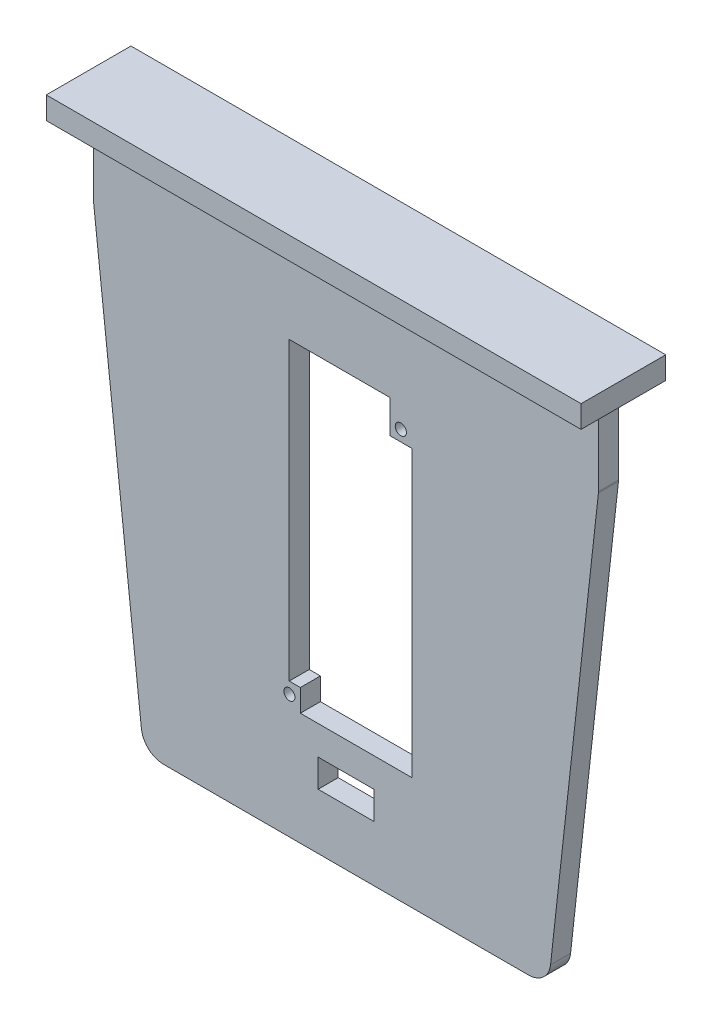
ISO-10303-21;
HEADER;
FILE_DESCRIPTION(('STEP AP214'),'2;1');
FILE_NAME('part.step','',(''),(''),'','','');
FILE_SCHEMA(('AUTOMOTIVE_DESIGN { 1 0 10303 214 1 1 1 1 }'));
ENDSEC;
DATA;
#1=APPLICATION_CONTEXT('core data for automotive mechanical design processes');
#2=APPLICATION_PROTOCOL_DEFINITION('international standard','automotive_design',2000,#1);
#3=PRODUCT_CONTEXT('',#1,'mechanical');
#4=PRODUCT('Part','Part','',(#3));
#5=PRODUCT_RELATED_PRODUCT_CATEGORY('part','',(#4));
#6=PRODUCT_DEFINITION_FORMATION('','',#4);
#7=PRODUCT_DEFINITION_CONTEXT('part definition',#1,'design');
#8=PRODUCT_DEFINITION('design','',#6,#7);
#9=PRODUCT_DEFINITION_SHAPE('','',#8);
#10=(LENGTH_UNIT() NAMED_UNIT(*) SI_UNIT(.MILLI.,.METRE.));
#11=(NAMED_UNIT(*) PLANE_ANGLE_UNIT() SI_UNIT($,.RADIAN.));
#12=(NAMED_UNIT(*) SI_UNIT($,.STERADIAN.) SOLID_ANGLE_UNIT());
#13=UNCERTAINTY_MEASURE_WITH_UNIT(LENGTH_MEASURE(1.E-05),#10,'distance_accuracy_value','');
#14=(GEOMETRIC_REPRESENTATION_CONTEXT(3) GLOBAL_UNCERTAINTY_ASSIGNED_CONTEXT((#13)) GLOBAL_UNIT_ASSIGNED_CONTEXT((#10,
#11,#12)) REPRESENTATION_CONTEXT('',''));
#15=CARTESIAN_POINT('',(0.,0.,0.));
#16=DIRECTION('',(0.,0.,1.));
#17=DIRECTION('',(1.,0.,0.));
#18=AXIS2_PLACEMENT_3D('',#15,#16,#17);
#19=CARTESIAN_POINT('',(-36.6639771710038,-49.3732840688926,-4.572));
#20=DIRECTION('',(0.,0.,1.));
#21=DIRECTION('',(1.,0.,0.));
#22=AXIS2_PLACEMENT_3D('',#19,#20,#21);
#23=CYLINDRICAL_SURFACE('',#22,5.08);
#24=CARTESIAN_POINT('',(-36.6639771710038,-49.3732840688926,0.));
#25=DIRECTION('',(0.,0.,-1.));
#26=DIRECTION('',(1.,0.,0.));
#27=AXIS2_PLACEMENT_3D('',#24,#25,#26);
#28=CIRCLE('',#27,5.08);
#29=CARTESIAN_POINT('',(-36.6639771710038,-54.4532840688926,0.));
#30=VERTEX_POINT('',#29);
#31=CARTESIAN_POINT('',(-41.7131564683568,-49.9320223109896,0.));
#32=VERTEX_POINT('',#31);
#33=EDGE_CURVE('E389',#30,#32,#28,.T.);
#34=ORIENTED_EDGE('',*,*,#33,.T.);
#35=DIRECTION('',(0.,0.,1.));
#36=VECTOR('',#35,1.);
#37=CARTESIAN_POINT('',(-41.7131564683568,-49.9320223109896,-4.572));
#38=LINE('',#37,#36);
#39=CARTESIAN_POINT('',(-41.7131564683568,-49.9320223109896,-4.572));
#40=VERTEX_POINT('',#39);
#41=EDGE_CURVE('E422',#40,#32,#38,.T.);
#42=ORIENTED_EDGE('',*,*,#41,.F.);
#43=CARTESIAN_POINT('',(-36.6639771710038,-49.3732840688926,-4.572));
#44=DIRECTION('',(0.,0.,-1.));
#45=DIRECTION('',(1.,0.,0.));
#46=AXIS2_PLACEMENT_3D('',#43,#44,#45);
#47=CIRCLE('',#46,5.08);
#48=CARTESIAN_POINT('',(-36.6639771710038,-54.4532840688926,-4.572));
#49=VERTEX_POINT('',#48);
#50=EDGE_CURVE('E390',#49,#40,#47,.T.);
#51=ORIENTED_EDGE('',*,*,#50,.F.);
#52=DIRECTION('',(0.,0.,1.));
#53=VECTOR('',#52,1.);
#54=CARTESIAN_POINT('',(-36.6639771710038,-54.4532840688926,-4.572));
#55=LINE('',#54,#53);
#56=EDGE_CURVE('E403',#49,#30,#55,.T.);
#57=ORIENTED_EDGE('',*,*,#56,.T.);
#58=EDGE_LOOP('',(#34,#42,#51,#57));
#59=FACE_BOUND('',#58,.T.);
#60=ADVANCED_FACE('F92',(#59),#23,.T.);
#61=CARTESIAN_POINT('',(-52.6441293610038,48.8484760890104,-4.572));
#62=DIRECTION('',(0.993932932549808,0.109987842932478,0.));
#63=DIRECTION('',(-0.109987842932478,0.993932932549808,0.));
#64=AXIS2_PLACEMENT_3D('',#61,#62,#63);
#65=PLANE('',#64);
#66=DIRECTION('',(-0.109987842932478,0.993932932549808,0.));
#67=VECTOR('',#66,1.);
#68=CARTESIAN_POINT('',(-52.6441293610038,48.8484760890104,0.));
#69=LINE('',#68,#67);
#70=CARTESIAN_POINT('',(-52.6287190096803,48.7092165556455,0.));
#71=VERTEX_POINT('',#70);
#72=EDGE_CURVE('E406',#32,#71,#69,.T.);
#73=ORIENTED_EDGE('',*,*,#72,.T.);
#74=DIRECTION('',(0.,0.,1.));
#75=VECTOR('',#74,1.);
#76=CARTESIAN_POINT('',(-52.6287190096803,48.7092165556455,-4.572));
#77=LINE('',#76,#75);
#78=CARTESIAN_POINT('',(-52.6287190096803,48.7092165556455,-4.572));
#79=VERTEX_POINT('',#78);
#80=EDGE_CURVE('E441',#71,#79,#77,.F.);
#81=ORIENTED_EDGE('',*,*,#80,.T.);
#82=DIRECTION('',(-0.109987842932478,0.993932932549808,0.));
#83=VECTOR('',#82,1.);
#84=CARTESIAN_POINT('',(-52.6441293610038,48.8484760890104,-4.572));
#85=LINE('',#84,#83);
#86=EDGE_CURVE('E393',#40,#79,#85,.T.);
#87=ORIENTED_EDGE('',*,*,#86,.F.);
#88=ORIENTED_EDGE('',*,*,#41,.T.);
#89=EDGE_LOOP('',(#73,#81,#87,#88));
#90=FACE_BOUND('',#89,.T.);
#91=ADVANCED_FACE('F521',(#90),#65,.F.);
#92=CARTESIAN_POINT('',(62.4874158389962,48.8484760890104,-4.572));
#93=DIRECTION('',(-0.993932932549808,0.109987842932478,0.));
#94=DIRECTION('',(-0.109987842932478,-0.993932932549808,0.));
#95=AXIS2_PLACEMENT_3D('',#92,#93,#94);
#96=PLANE('',#95);
#97=DIRECTION('',(-0.109987842932478,-0.993932932549808,0.));
#98=VECTOR('',#97,1.);
#99=CARTESIAN_POINT('',(62.4874158389962,48.8484760890104,-4.572));
#100=LINE('',#99,#98);
#101=CARTESIAN_POINT('',(62.4720054876727,48.7092165556455,-4.572));
#102=VERTEX_POINT('',#101);
#103=CARTESIAN_POINT('',(51.5564429463492,-49.9320223109896,-4.572));
#104=VERTEX_POINT('',#103);
#105=EDGE_CURVE('E397',#102,#104,#100,.T.);
#106=ORIENTED_EDGE('',*,*,#105,.F.);
#107=DIRECTION('',(0.,0.,1.));
#108=VECTOR('',#107,1.);
#109=CARTESIAN_POINT('',(62.4720054876727,48.7092165556455,-4.572));
#110=LINE('',#109,#108);
#111=CARTESIAN_POINT('',(62.4720054876727,48.7092165556455,0.));
#112=VERTEX_POINT('',#111);
#113=EDGE_CURVE('E425',#102,#112,#110,.T.);
#114=ORIENTED_EDGE('',*,*,#113,.T.);
#115=DIRECTION('',(-0.109987842932478,-0.993932932549808,0.));
#116=VECTOR('',#115,1.);
#117=CARTESIAN_POINT('',(62.4874158389962,48.8484760890104,0.));
#118=LINE('',#117,#116);
#119=CARTESIAN_POINT('',(51.5564429463492,-49.9320223109896,0.));
#120=VERTEX_POINT('',#119);
#121=EDGE_CURVE('E409',#112,#120,#118,.T.);
#122=ORIENTED_EDGE('',*,*,#121,.T.);
#123=DIRECTION('',(0.,0.,1.));
#124=VECTOR('',#123,1.);
#125=CARTESIAN_POINT('',(51.5564429463492,-49.9320223109896,-4.572));
#126=LINE('',#125,#124);
#127=EDGE_CURVE('E419',#104,#120,#126,.T.);
#128=ORIENTED_EDGE('',*,*,#127,.F.);
#129=EDGE_LOOP('',(#106,#114,#122,#128));
#130=FACE_BOUND('',#129,.T.);
#131=ADVANCED_FACE('F493',(#130),#96,.F.);
#132=CARTESIAN_POINT('',(46.5072636489962,-49.3732840688926,-4.572));
#133=DIRECTION('',(0.,0.,1.));
#134=DIRECTION('',(1.,0.,0.));
#135=AXIS2_PLACEMENT_3D('',#132,#133,#134);
#136=CYLINDRICAL_SURFACE('',#135,5.08);
#137=CARTESIAN_POINT('',(46.5072636489962,-49.3732840688926,0.));
#138=DIRECTION('',(0.,0.,-1.));
#139=DIRECTION('',(-1.,0.,0.));
#140=AXIS2_PLACEMENT_3D('',#137,#138,#139);
#141=CIRCLE('',#140,5.08);
#142=CARTESIAN_POINT('',(46.5072636489962,-54.4532840688926,0.));
#143=VERTEX_POINT('',#142);
#144=EDGE_CURVE('E411',#120,#143,#141,.T.);
#145=ORIENTED_EDGE('',*,*,#144,.T.);
#146=DIRECTION('',(0.,0.,1.));
#147=VECTOR('',#146,1.);
#148=CARTESIAN_POINT('',(46.5072636489962,-54.4532840688926,-4.572));
#149=LINE('',#148,#147);
#150=CARTESIAN_POINT('',(46.5072636489962,-54.4532840688926,-4.572));
#151=VERTEX_POINT('',#150);
#152=EDGE_CURVE('E416',#151,#143,#149,.T.);
#153=ORIENTED_EDGE('',*,*,#152,.F.);
#154=CARTESIAN_POINT('',(46.5072636489962,-49.3732840688926,-4.572));
#155=DIRECTION('',(0.,0.,-1.));
#156=DIRECTION('',(-1.,0.,0.));
#157=AXIS2_PLACEMENT_3D('',#154,#155,#156);
#158=CIRCLE('',#157,5.08);
#159=EDGE_CURVE('E399',#104,#151,#158,.T.);
#160=ORIENTED_EDGE('',*,*,#159,.F.);
#161=ORIENTED_EDGE('',*,*,#127,.T.);
#162=EDGE_LOOP('',(#145,#153,#160,#161));
#163=FACE_BOUND('',#162,.T.);
#164=ADVANCED_FACE('F497',(#163),#136,.T.);
#165=CARTESIAN_POINT('',(-36.6639771710038,-54.4532840688926,-4.572));
#166=DIRECTION('',(0.,1.,0.));
#167=DIRECTION('',(0.,0.,1.));
#168=AXIS2_PLACEMENT_3D('',#165,#166,#167);
#169=PLANE('',#168);
#170=DIRECTION('',(-1.,0.,0.));
#171=VECTOR('',#170,1.);
#172=CARTESIAN_POINT('',(-36.6639771710038,-54.4532840688926,0.));
#173=LINE('',#172,#171);
#174=EDGE_CURVE('E394',#143,#30,#173,.T.);
#175=ORIENTED_EDGE('',*,*,#174,.T.);
#176=ORIENTED_EDGE('',*,*,#56,.F.);
#177=DIRECTION('',(-1.,0.,0.));
#178=VECTOR('',#177,1.);
#179=CARTESIAN_POINT('',(-36.6639771710038,-54.4532840688926,-4.572));
#180=LINE('',#179,#178);
#181=EDGE_CURVE('E401',#151,#49,#180,.T.);
#182=ORIENTED_EDGE('',*,*,#181,.F.);
#183=ORIENTED_EDGE('',*,*,#152,.T.);
#184=EDGE_LOOP('',(#175,#176,#182,#183));
#185=FACE_BOUND('',#184,.T.);
#186=ADVANCED_FACE('F527',(#185),#169,.F.);
#187=CARTESIAN_POINT('',(-36.6639771710038,-49.3732840688926,-4.572));
#188=DIRECTION('',(0.,0.,1.));
#189=DIRECTION('',(1.,0.,0.));
#190=AXIS2_PLACEMENT_3D('',#187,#188,#189);
#191=PLANE('',#190);
#192=CARTESIAN_POINT('',(-7.97835676100378,-26.2715239109896,-4.572));
#193=DIRECTION('',(0.,0.,-1.));
#194=DIRECTION('',(-1.,0.,0.));
#195=AXIS2_PLACEMENT_3D('',#192,#193,#194);
#196=CIRCLE('',#195,1.27);
#197=CARTESIAN_POINT('',(-9.24835676100378,-26.2715239109896,-4.572));
#198=VERTEX_POINT('',#197);
#199=EDGE_CURVE('E632',#198,#198,#196,.T.);
#200=ORIENTED_EDGE('',*,*,#199,.F.);
#201=EDGE_LOOP('',(#200));
#202=FACE_BOUND('',#201,.T.);
#203=CARTESIAN_POINT('',(17.4216432389962,38.7284760890104,-4.572));
#204=DIRECTION('',(0.,0.,-1.));
#205=DIRECTION('',(-1.,0.,0.));
#206=AXIS2_PLACEMENT_3D('',#203,#204,#205);
#207=CIRCLE('',#206,1.27);
#208=CARTESIAN_POINT('',(16.1516432389962,38.7284760890104,-4.572));
#209=VERTEX_POINT('',#208);
#210=EDGE_CURVE('E630',#209,#209,#207,.T.);
#211=ORIENTED_EDGE('',*,*,#210,.F.);
#212=EDGE_LOOP('',(#211));
#213=FACE_BOUND('',#212,.T.);
#214=DIRECTION('',(0.,1.,0.));
#215=VECTOR('',#214,1.);
#216=CARTESIAN_POINT('',(-8.01835676100379,0.,-4.572));
#217=LINE('',#216,#215);
#218=CARTESIAN_POINT('',(-8.01835676100379,-23.6915239109896,-4.572));
#219=VERTEX_POINT('',#218);
#220=CARTESIAN_POINT('',(-8.01835676100379,43.7684760890104,-4.572));
#221=VERTEX_POINT('',#220);
#222=EDGE_CURVE('E278',#219,#221,#217,.T.);
#223=ORIENTED_EDGE('',*,*,#222,.F.);
#224=DIRECTION('',(-1.,0.,0.));
#225=VECTOR('',#224,1.);
#226=CARTESIAN_POINT('',(0.,-23.6915239109896,-4.572));
#227=LINE('',#226,#225);
#228=CARTESIAN_POINT('',(-5.47835676100378,-23.6915239109896,-4.572));
#229=VERTEX_POINT('',#228);
#230=EDGE_CURVE('E109',#229,#219,#227,.T.);
#231=ORIENTED_EDGE('',*,*,#230,.F.);
#232=DIRECTION('',(0.,1.,0.));
#233=VECTOR('',#232,1.);
#234=CARTESIAN_POINT('',(-5.47835676100378,0.,-4.572));
#235=LINE('',#234,#233);
#236=CARTESIAN_POINT('',(-5.47835676100378,-28.7715239109896,-4.572));
#237=VERTEX_POINT('',#236);
#238=EDGE_CURVE('E299',#237,#229,#235,.T.);
#239=ORIENTED_EDGE('',*,*,#238,.F.);
#240=DIRECTION('',(-1.,0.,0.));
#241=VECTOR('',#240,1.);
#242=CARTESIAN_POINT('',(0.,-28.7715239109896,-4.572));
#243=LINE('',#242,#241);
#244=CARTESIAN_POINT('',(19.9216432389962,-28.7715239109896,-4.572));
#245=VERTEX_POINT('',#244);
#246=EDGE_CURVE('E296',#245,#237,#243,.T.);
#247=ORIENTED_EDGE('',*,*,#246,.F.);
#248=DIRECTION('',(0.,-1.,0.));
#249=VECTOR('',#248,1.);
#250=CARTESIAN_POINT('',(19.9216432389962,0.,-4.572));
#251=LINE('',#250,#249);
#252=CARTESIAN_POINT('',(19.9216432389962,36.2284760890104,-4.572));
#253=VERTEX_POINT('',#252);
#254=EDGE_CURVE('E293',#253,#245,#251,.T.);
#255=ORIENTED_EDGE('',*,*,#254,.F.);
#256=DIRECTION('',(-1.,0.,0.));
#257=VECTOR('',#256,1.);
#258=CARTESIAN_POINT('',(0.,36.2284760890104,-4.572));
#259=LINE('',#258,#257);
#260=CARTESIAN_POINT('',(14.9216432389962,36.2284760890104,-4.572));
#261=VERTEX_POINT('',#260);
#262=EDGE_CURVE('E288',#253,#261,#259,.T.);
#263=ORIENTED_EDGE('',*,*,#262,.T.);
#264=DIRECTION('',(0.,1.,0.));
#265=VECTOR('',#264,1.);
#266=CARTESIAN_POINT('',(14.9216432389962,0.,-4.572));
#267=LINE('',#266,#265);
#268=CARTESIAN_POINT('',(14.9216432389962,43.7684760890104,-4.572));
#269=VERTEX_POINT('',#268);
#270=EDGE_CURVE('E286',#261,#269,#267,.T.);
#271=ORIENTED_EDGE('',*,*,#270,.T.);
#272=DIRECTION('',(-1.,0.,0.));
#273=VECTOR('',#272,1.);
#274=CARTESIAN_POINT('',(0.,43.7684760890104,-4.572));
#275=LINE('',#274,#273);
#276=EDGE_CURVE('E269',#269,#221,#275,.T.);
#277=ORIENTED_EDGE('',*,*,#276,.T.);
#278=EDGE_LOOP('',(#223,#231,#239,#247,#255,#263,#271,#277));
#279=FACE_BOUND('',#278,.T.);
#280=DIRECTION('',(-1.,0.,0.));
#281=VECTOR('',#280,1.);
#282=CARTESIAN_POINT('',(11.2716432389962,-41.7532840688926,-4.572));
#283=LINE('',#282,#281);
#284=CARTESIAN_POINT('',(11.2716432389962,-41.7532840688926,-4.572));
#285=VERTEX_POINT('',#284);
#286=CARTESIAN_POINT('',(-1.42835676100378,-41.7532840688926,-4.572));
#287=VERTEX_POINT('',#286);
#288=EDGE_CURVE('E317',#285,#287,#283,.T.);
#289=ORIENTED_EDGE('',*,*,#288,.F.);
#290=DIRECTION('',(0.,-1.,0.));
#291=VECTOR('',#290,1.);
#292=CARTESIAN_POINT('',(11.2716432389962,-35.4032840688926,-4.572));
#293=LINE('',#292,#291);
#294=CARTESIAN_POINT('',(11.2716432389962,-35.4032840688926,-4.572));
#295=VERTEX_POINT('',#294);
#296=EDGE_CURVE('E315',#295,#285,#293,.T.);
#297=ORIENTED_EDGE('',*,*,#296,.F.);
#298=DIRECTION('',(1.,0.,0.));
#299=VECTOR('',#298,1.);
#300=CARTESIAN_POINT('',(-1.42835676100377,-35.4032840688926,-4.572));
#301=LINE('',#300,#299);
#302=CARTESIAN_POINT('',(-1.42835676100377,-35.4032840688926,-4.572));
#303=VERTEX_POINT('',#302);
#304=EDGE_CURVE('E323',#303,#295,#301,.T.);
#305=ORIENTED_EDGE('',*,*,#304,.F.);
#306=DIRECTION('',(0.,1.,0.));
#307=VECTOR('',#306,1.);
#308=CARTESIAN_POINT('',(-1.42835676100377,-35.4032840688926,-4.572));
#309=LINE('',#308,#307);
#310=EDGE_CURVE('E320',#287,#303,#309,.T.);
#311=ORIENTED_EDGE('',*,*,#310,.F.);
#312=EDGE_LOOP('',(#289,#297,#305,#311));
#313=FACE_BOUND('',#312,.T.);
#314=DIRECTION('',(0.,-1.,0.));
#315=VECTOR('',#314,1.);
#316=CARTESIAN_POINT('',(62.4874158389962,66.6284760890104,-4.57200000000004));
#317=LINE('',#316,#315);
#318=CARTESIAN_POINT('',(62.4874158389962,66.6284760890104,-4.57200000000004));
#319=VERTEX_POINT('',#318);
#320=CARTESIAN_POINT('',(62.4874158389962,48.988585676694,-4.57200000000004));
#321=VERTEX_POINT('',#320);
#322=EDGE_CURVE('E377',#319,#321,#317,.T.);
#323=ORIENTED_EDGE('',*,*,#322,.T.);
#324=CARTESIAN_POINT('',(59.9474158389962,48.988585676694,-4.572));
#325=DIRECTION('',(0.,0.,1.));
#326=DIRECTION('',(1.,0.,0.));
#327=AXIS2_PLACEMENT_3D('',#324,#325,#326);
#328=CIRCLE('',#327,2.54);
#329=EDGE_CURVE('E436',#321,#102,#328,.F.);
#330=ORIENTED_EDGE('',*,*,#329,.T.);
#331=ORIENTED_EDGE('',*,*,#105,.T.);
#332=ORIENTED_EDGE('',*,*,#159,.T.);
#333=ORIENTED_EDGE('',*,*,#181,.T.);
#334=ORIENTED_EDGE('',*,*,#50,.T.);
#335=ORIENTED_EDGE('',*,*,#86,.T.);
#336=CARTESIAN_POINT('',(-50.1041293610038,48.988585676694,-4.572));
#337=DIRECTION('',(0.,0.,1.));
#338=DIRECTION('',(1.,0.,0.));
#339=AXIS2_PLACEMENT_3D('',#336,#337,#338);
#340=CIRCLE('',#339,2.54);
#341=CARTESIAN_POINT('',(-52.6441293610038,48.988585676694,-4.572));
#342=VERTEX_POINT('',#341);
#343=EDGE_CURVE('E434',#79,#342,#340,.F.);
#344=ORIENTED_EDGE('',*,*,#343,.T.);
#345=DIRECTION('',(0.,-1.,0.));
#346=VECTOR('',#345,1.);
#347=CARTESIAN_POINT('',(-52.6441293610038,66.6284760890104,-4.572));
#348=LINE('',#347,#346);
#349=CARTESIAN_POINT('',(-52.6441293610038,66.6284760890104,-4.572));
#350=VERTEX_POINT('',#349);
#351=EDGE_CURVE('E386',#350,#342,#348,.T.);
#352=ORIENTED_EDGE('',*,*,#351,.F.);
#353=DIRECTION('',(-1.,0.,0.));
#354=VECTOR('',#353,1.);
#355=CARTESIAN_POINT('',(-52.6441293610038,66.6284760890104,-4.572));
#356=LINE('',#355,#354);
#357=EDGE_CURVE('E365',#319,#350,#356,.T.);
#358=ORIENTED_EDGE('',*,*,#357,.F.);
#359=EDGE_LOOP('',(#323,#330,#331,#332,#333,#334,#335,#344,#352,#358));
#360=FACE_BOUND('',#359,.T.);
#361=ADVANCED_FACE('F282',(#202,#213,#279,#313,#360),#191,.F.);
#362=CARTESIAN_POINT('',(-36.6639771710038,-49.3732840688926,0.));
#363=DIRECTION('',(0.,0.,1.));
#364=DIRECTION('',(1.,0.,0.));
#365=AXIS2_PLACEMENT_3D('',#362,#363,#364);
#366=PLANE('',#365);
#367=CARTESIAN_POINT('',(-7.97835676100378,-26.2715239109896,0.));
#368=DIRECTION('',(0.,0.,1.));
#369=DIRECTION('',(1.,0.,0.));
#370=AXIS2_PLACEMENT_3D('',#367,#368,#369);
#371=CIRCLE('',#370,1.27);
#372=CARTESIAN_POINT('',(-6.70835676100378,-26.2715239109896,0.));
#373=VERTEX_POINT('',#372);
#374=EDGE_CURVE('E96',#373,#373,#371,.T.);
#375=ORIENTED_EDGE('',*,*,#374,.F.);
#376=EDGE_LOOP('',(#375));
#377=FACE_BOUND('',#376,.T.);
#378=CARTESIAN_POINT('',(17.4216432389962,38.7284760890104,0.));
#379=DIRECTION('',(0.,0.,1.));
#380=DIRECTION('',(1.,0.,0.));
#381=AXIS2_PLACEMENT_3D('',#378,#379,#380);
#382=CIRCLE('',#381,1.27);
#383=CARTESIAN_POINT('',(18.6916432389962,38.7284760890104,0.));
#384=VERTEX_POINT('',#383);
#385=EDGE_CURVE('E304',#384,#384,#382,.T.);
#386=ORIENTED_EDGE('',*,*,#385,.F.);
#387=EDGE_LOOP('',(#386));
#388=FACE_BOUND('',#387,.T.);
#389=DIRECTION('',(1.,0.,0.));
#390=VECTOR('',#389,1.);
#391=CARTESIAN_POINT('',(-36.6639771710038,-23.6915239109896,0.));
#392=LINE('',#391,#390);
#393=CARTESIAN_POINT('',(-8.01835676100379,-23.6915239109896,0.));
#394=VERTEX_POINT('',#393);
#395=CARTESIAN_POINT('',(-5.47835676100378,-23.6915239109896,0.));
#396=VERTEX_POINT('',#395);
#397=EDGE_CURVE('E12',#394,#396,#392,.T.);
#398=ORIENTED_EDGE('',*,*,#397,.F.);
#399=DIRECTION('',(0.,-1.,0.));
#400=VECTOR('',#399,1.);
#401=CARTESIAN_POINT('',(-8.01835676100379,-49.3732840688926,0.));
#402=LINE('',#401,#400);
#403=CARTESIAN_POINT('',(-8.01835676100379,43.7684760890104,0.));
#404=VERTEX_POINT('',#403);
#405=EDGE_CURVE('E452',#404,#394,#402,.T.);
#406=ORIENTED_EDGE('',*,*,#405,.F.);
#407=DIRECTION('',(1.,0.,0.));
#408=VECTOR('',#407,1.);
#409=CARTESIAN_POINT('',(-36.6639771710038,43.7684760890104,0.));
#410=LINE('',#409,#408);
#411=CARTESIAN_POINT('',(14.9216432389962,43.7684760890104,0.));
#412=VERTEX_POINT('',#411);
#413=EDGE_CURVE('E272',#404,#412,#410,.T.);
#414=ORIENTED_EDGE('',*,*,#413,.T.);
#415=DIRECTION('',(0.,-1.,0.));
#416=VECTOR('',#415,1.);
#417=CARTESIAN_POINT('',(14.9216432389962,-49.3732840688927,0.));
#418=LINE('',#417,#416);
#419=CARTESIAN_POINT('',(14.9216432389962,36.2284760890104,0.));
#420=VERTEX_POINT('',#419);
#421=EDGE_CURVE('E455',#412,#420,#418,.T.);
#422=ORIENTED_EDGE('',*,*,#421,.T.);
#423=DIRECTION('',(1.,0.,0.));
#424=VECTOR('',#423,1.);
#425=CARTESIAN_POINT('',(-36.6639771710038,36.2284760890104,0.));
#426=LINE('',#425,#424);
#427=CARTESIAN_POINT('',(19.9216432389962,36.2284760890104,0.));
#428=VERTEX_POINT('',#427);
#429=EDGE_CURVE('E458',#420,#428,#426,.T.);
#430=ORIENTED_EDGE('',*,*,#429,.T.);
#431=DIRECTION('',(0.,1.,0.));
#432=VECTOR('',#431,1.);
#433=CARTESIAN_POINT('',(19.9216432389962,-49.3732840688926,0.));
#434=LINE('',#433,#432);
#435=CARTESIAN_POINT('',(19.9216432389962,-28.7715239109896,0.));
#436=VERTEX_POINT('',#435);
#437=EDGE_CURVE('E461',#436,#428,#434,.T.);
#438=ORIENTED_EDGE('',*,*,#437,.F.);
#439=DIRECTION('',(1.,0.,0.));
#440=VECTOR('',#439,1.);
#441=CARTESIAN_POINT('',(-36.6639771710038,-28.7715239109896,0.));
#442=LINE('',#441,#440);
#443=CARTESIAN_POINT('',(-5.47835676100378,-28.7715239109896,0.));
#444=VERTEX_POINT('',#443);
#445=EDGE_CURVE('E463',#444,#436,#442,.T.);
#446=ORIENTED_EDGE('',*,*,#445,.F.);
#447=DIRECTION('',(0.,-1.,0.));
#448=VECTOR('',#447,1.);
#449=CARTESIAN_POINT('',(-5.47835676100378,-49.3732840688926,0.));
#450=LINE('',#449,#448);
#451=EDGE_CURVE('E101',#396,#444,#450,.T.);
#452=ORIENTED_EDGE('',*,*,#451,.F.);
#453=EDGE_LOOP('',(#398,#406,#414,#422,#430,#438,#446,#452));
#454=FACE_BOUND('',#453,.T.);
#455=DIRECTION('',(0.,1.,0.));
#456=VECTOR('',#455,1.);
#457=CARTESIAN_POINT('',(11.2716432389962,-49.3732840688926,0.));
#458=LINE('',#457,#456);
#459=CARTESIAN_POINT('',(11.2716432389962,-41.7532840688926,0.));
#460=VERTEX_POINT('',#459);
#461=CARTESIAN_POINT('',(11.2716432389962,-35.4032840688926,0.));
#462=VERTEX_POINT('',#461);
#463=EDGE_CURVE('E450',#460,#462,#458,.T.);
#464=ORIENTED_EDGE('',*,*,#463,.F.);
#465=DIRECTION('',(1.,0.,0.));
#466=VECTOR('',#465,1.);
#467=CARTESIAN_POINT('',(-36.6639771710038,-41.7532840688926,0.));
#468=LINE('',#467,#466);
#469=CARTESIAN_POINT('',(-1.42835676100377,-41.7532840688926,0.));
#470=VERTEX_POINT('',#469);
#471=EDGE_CURVE('E443',#470,#460,#468,.T.);
#472=ORIENTED_EDGE('',*,*,#471,.F.);
#473=DIRECTION('',(0.,-1.,0.));
#474=VECTOR('',#473,1.);
#475=CARTESIAN_POINT('',(-1.42835676100378,-49.3732840688927,0.));
#476=LINE('',#475,#474);
#477=CARTESIAN_POINT('',(-1.42835676100377,-35.4032840688926,0.));
#478=VERTEX_POINT('',#477);
#479=EDGE_CURVE('E445',#478,#470,#476,.T.);
#480=ORIENTED_EDGE('',*,*,#479,.F.);
#481=DIRECTION('',(-1.,0.,0.));
#482=VECTOR('',#481,1.);
#483=CARTESIAN_POINT('',(-36.6639771710038,-35.4032840688926,0.));
#484=LINE('',#483,#482);
#485=EDGE_CURVE('E448',#462,#478,#484,.T.);
#486=ORIENTED_EDGE('',*,*,#485,.F.);
#487=EDGE_LOOP('',(#464,#472,#480,#486));
#488=FACE_BOUND('',#487,.T.);
#489=ORIENTED_EDGE('',*,*,#121,.F.);
#490=CARTESIAN_POINT('',(59.9474158389962,48.988585676694,0.));
#491=DIRECTION('',(0.,0.,1.));
#492=DIRECTION('',(1.,0.,0.));
#493=AXIS2_PLACEMENT_3D('',#490,#491,#492);
#494=CIRCLE('',#493,2.54);
#495=CARTESIAN_POINT('',(62.4874158389962,48.988585676694,0.));
#496=VERTEX_POINT('',#495);
#497=EDGE_CURVE('E430',#112,#496,#494,.T.);
#498=ORIENTED_EDGE('',*,*,#497,.T.);
#499=DIRECTION('',(0.,-1.,0.));
#500=VECTOR('',#499,1.);
#501=CARTESIAN_POINT('',(62.4874158389962,66.6284760890104,0.));
#502=LINE('',#501,#500);
#503=CARTESIAN_POINT('',(62.4874158389962,66.6284760890104,0.));
#504=VERTEX_POINT('',#503);
#505=EDGE_CURVE('E380',#504,#496,#502,.T.);
#506=ORIENTED_EDGE('',*,*,#505,.F.);
#507=DIRECTION('',(1.,0.,0.));
#508=VECTOR('',#507,1.);
#509=CARTESIAN_POINT('',(-52.6441293610038,66.6284760890104,0.));
#510=LINE('',#509,#508);
#511=CARTESIAN_POINT('',(-52.6441293610038,66.6284760890104,0.));
#512=VERTEX_POINT('',#511);
#513=EDGE_CURVE('E371',#512,#504,#510,.T.);
#514=ORIENTED_EDGE('',*,*,#513,.F.);
#515=DIRECTION('',(0.,-1.,0.));
#516=VECTOR('',#515,1.);
#517=CARTESIAN_POINT('',(-52.6441293610038,66.6284760890104,0.));
#518=LINE('',#517,#516);
#519=CARTESIAN_POINT('',(-52.6441293610038,48.988585676694,0.));
#520=VERTEX_POINT('',#519);
#521=EDGE_CURVE('E383',#512,#520,#518,.T.);
#522=ORIENTED_EDGE('',*,*,#521,.T.);
#523=CARTESIAN_POINT('',(-50.1041293610038,48.988585676694,0.));
#524=DIRECTION('',(0.,0.,1.));
#525=DIRECTION('',(1.,0.,0.));
#526=AXIS2_PLACEMENT_3D('',#523,#524,#525);
#527=CIRCLE('',#526,2.54);
#528=EDGE_CURVE('E428',#520,#71,#527,.T.);
#529=ORIENTED_EDGE('',*,*,#528,.T.);
#530=ORIENTED_EDGE('',*,*,#72,.F.);
#531=ORIENTED_EDGE('',*,*,#33,.F.);
#532=ORIENTED_EDGE('',*,*,#174,.F.);
#533=ORIENTED_EDGE('',*,*,#144,.F.);
#534=EDGE_LOOP('',(#489,#498,#506,#514,#522,#529,#530,#531,#532,#533));
#535=FACE_BOUND('',#534,.T.);
#536=ADVANCED_FACE('F474',(#377,#388,#454,#488,#535),#366,.T.);
#537=CARTESIAN_POINT('',(-52.6441293610038,66.6284760890104,-4.572));
#538=DIRECTION('',(1.,0.,0.));
#539=DIRECTION('',(0.,0.,-1.));
#540=AXIS2_PLACEMENT_3D('',#537,#538,#539);
#541=PLANE('',#540);
#542=ORIENTED_EDGE('',*,*,#351,.T.);
#543=DIRECTION('',(0.,0.,1.));
#544=VECTOR('',#543,1.);
#545=CARTESIAN_POINT('',(-52.6441293610038,48.988585676694,-4.572));
#546=LINE('',#545,#544);
#547=EDGE_CURVE('E438',#342,#520,#546,.T.);
#548=ORIENTED_EDGE('',*,*,#547,.T.);
#549=ORIENTED_EDGE('',*,*,#521,.F.);
#550=DIRECTION('',(0.,0.,1.));
#551=VECTOR('',#550,1.);
#552=CARTESIAN_POINT('',(-52.6441293610038,66.6284760890104,-4.572));
#553=LINE('',#552,#551);
#554=EDGE_CURVE('E368',#350,#512,#553,.T.);
#555=ORIENTED_EDGE('',*,*,#554,.F.);
#556=EDGE_LOOP('',(#542,#548,#549,#555));
#557=FACE_BOUND('',#556,.T.);
#558=ADVANCED_FACE('F477',(#557),#541,.F.);
#559=CARTESIAN_POINT('',(62.4874158389962,66.6284760890104,-4.57200000000004));
#560=DIRECTION('',(-1.,0.,0.));
#561=DIRECTION('',(0.,0.,1.));
#562=AXIS2_PLACEMENT_3D('',#559,#560,#561);
#563=PLANE('',#562);
#564=ORIENTED_EDGE('',*,*,#505,.T.);
#565=DIRECTION('',(0.,0.,1.));
#566=VECTOR('',#565,1.);
#567=CARTESIAN_POINT('',(62.4874158389962,48.988585676694,-4.57200000000004));
#568=LINE('',#567,#566);
#569=EDGE_CURVE('E432',#496,#321,#568,.F.);
#570=ORIENTED_EDGE('',*,*,#569,.T.);
#571=ORIENTED_EDGE('',*,*,#322,.F.);
#572=DIRECTION('',(0.,0.,-1.));
#573=VECTOR('',#572,1.);
#574=CARTESIAN_POINT('',(62.4874158389962,66.6284760890104,-4.57200000000004));
#575=LINE('',#574,#573);
#576=EDGE_CURVE('E374',#504,#319,#575,.T.);
#577=ORIENTED_EDGE('',*,*,#576,.F.);
#578=EDGE_LOOP('',(#564,#570,#571,#577));
#579=FACE_BOUND('',#578,.T.);
#580=ADVANCED_FACE('F508',(#579),#563,.F.);
#581=CARTESIAN_POINT('',(59.9474158389962,48.988585676694,-4.572));
#582=DIRECTION('',(0.,0.,1.));
#583=DIRECTION('',(1.,0.,0.));
#584=AXIS2_PLACEMENT_3D('',#581,#582,#583);
#585=CYLINDRICAL_SURFACE('',#584,2.54);
#586=ORIENTED_EDGE('',*,*,#329,.F.);
#587=ORIENTED_EDGE('',*,*,#569,.F.);
#588=ORIENTED_EDGE('',*,*,#497,.F.);
#589=ORIENTED_EDGE('',*,*,#113,.F.);
#590=EDGE_LOOP('',(#586,#587,#588,#589));
#591=FACE_BOUND('',#590,.T.);
#592=ADVANCED_FACE('F504',(#591),#585,.T.);
#593=CARTESIAN_POINT('',(-50.1041293610038,48.988585676694,-4.572));
#594=DIRECTION('',(0.,0.,1.));
#595=DIRECTION('',(1.,0.,0.));
#596=AXIS2_PLACEMENT_3D('',#593,#594,#595);
#597=CYLINDRICAL_SURFACE('',#596,2.54);
#598=ORIENTED_EDGE('',*,*,#343,.F.);
#599=ORIENTED_EDGE('',*,*,#80,.F.);
#600=ORIENTED_EDGE('',*,*,#528,.F.);
#601=ORIENTED_EDGE('',*,*,#547,.F.);
#602=EDGE_LOOP('',(#598,#599,#600,#601));
#603=FACE_BOUND('',#602,.T.);
#604=ADVANCED_FACE('F94',(#603),#597,.T.);
#605=CARTESIAN_POINT('',(-56.0383567610038,71.7084760890104,-11.938));
#606=DIRECTION('',(0.,0.,1.));
#607=DIRECTION('',(1.,0.,0.));
#608=AXIS2_PLACEMENT_3D('',#605,#606,#607);
#609=PLANE('',#608);
#610=DIRECTION('',(-1.,0.,0.));
#611=VECTOR('',#610,1.);
#612=CARTESIAN_POINT('',(-56.0383567610038,66.6284760890104,-11.938));
#613=LINE('',#612,#611);
#614=CARTESIAN_POINT('',(65.8816432389962,66.6284760890104,-11.9380000000001));
#615=VERTEX_POINT('',#614);
#616=CARTESIAN_POINT('',(-56.0383567610038,66.6284760890104,-11.938));
#617=VERTEX_POINT('',#616);
#618=EDGE_CURVE('E329',#615,#617,#613,.T.);
#619=ORIENTED_EDGE('',*,*,#618,.T.);
#620=DIRECTION('',(0.,-1.,0.));
#621=VECTOR('',#620,1.);
#622=CARTESIAN_POINT('',(-56.0383567610038,71.7084760890104,-11.938));
#623=LINE('',#622,#621);
#624=CARTESIAN_POINT('',(-56.0383567610038,71.7084760890104,-11.938));
#625=VERTEX_POINT('',#624);
#626=EDGE_CURVE('E362',#625,#617,#623,.T.);
#627=ORIENTED_EDGE('',*,*,#626,.F.);
#628=DIRECTION('',(-1.,0.,0.));
#629=VECTOR('',#628,1.);
#630=CARTESIAN_POINT('',(-56.0383567610038,71.7084760890104,-11.938));
#631=LINE('',#630,#629);
#632=CARTESIAN_POINT('',(65.8816432389962,71.7084760890104,-11.9380000000001));
#633=VERTEX_POINT('',#632);
#634=EDGE_CURVE('E336',#633,#625,#631,.T.);
#635=ORIENTED_EDGE('',*,*,#634,.F.);
#636=DIRECTION('',(0.,-1.,0.));
#637=VECTOR('',#636,1.);
#638=CARTESIAN_POINT('',(65.8816432389962,71.7084760890104,-11.9380000000001));
#639=LINE('',#638,#637);
#640=EDGE_CURVE('E346',#633,#615,#639,.T.);
#641=ORIENTED_EDGE('',*,*,#640,.T.);
#642=EDGE_LOOP('',(#619,#627,#635,#641));
#643=FACE_BOUND('',#642,.T.);
#644=ADVANCED_FACE('F550',(#643),#609,.F.);
#645=CARTESIAN_POINT('',(-56.0383567610038,71.7084760890104,-11.938));
#646=DIRECTION('',(1.,0.,0.));
#647=DIRECTION('',(0.,0.,-1.));
#648=AXIS2_PLACEMENT_3D('',#645,#646,#647);
#649=PLANE('',#648);
#650=DIRECTION('',(0.,0.,1.));
#651=VECTOR('',#650,1.);
#652=CARTESIAN_POINT('',(-56.0383567610038,66.6284760890104,-11.938));
#653=LINE('',#652,#651);
#654=CARTESIAN_POINT('',(-56.0383567610038,66.6284760890104,7.366));
#655=VERTEX_POINT('',#654);
#656=EDGE_CURVE('E349',#617,#655,#653,.T.);
#657=ORIENTED_EDGE('',*,*,#656,.T.);
#658=DIRECTION('',(0.,-1.,0.));
#659=VECTOR('',#658,1.);
#660=CARTESIAN_POINT('',(-56.0383567610038,71.7084760890104,7.366));
#661=LINE('',#660,#659);
#662=CARTESIAN_POINT('',(-56.0383567610038,71.7084760890104,7.366));
#663=VERTEX_POINT('',#662);
#664=EDGE_CURVE('E359',#663,#655,#661,.T.);
#665=ORIENTED_EDGE('',*,*,#664,.F.);
#666=DIRECTION('',(0.,0.,1.));
#667=VECTOR('',#666,1.);
#668=CARTESIAN_POINT('',(-56.0383567610038,71.7084760890104,-11.938));
#669=LINE('',#668,#667);
#670=EDGE_CURVE('E339',#625,#663,#669,.T.);
#671=ORIENTED_EDGE('',*,*,#670,.F.);
#672=ORIENTED_EDGE('',*,*,#626,.T.);
#673=EDGE_LOOP('',(#657,#665,#671,#672));
#674=FACE_BOUND('',#673,.T.);
#675=ADVANCED_FACE('F559',(#674),#649,.F.);
#676=CARTESIAN_POINT('',(-56.0383567610038,71.7084760890104,7.366));
#677=DIRECTION('',(0.,0.,-1.));
#678=DIRECTION('',(-1.,0.,0.));
#679=AXIS2_PLACEMENT_3D('',#676,#677,#678);
#680=PLANE('',#679);
#681=DIRECTION('',(1.,0.,0.));
#682=VECTOR('',#681,1.);
#683=CARTESIAN_POINT('',(-56.0383567610038,66.6284760890104,7.366));
#684=LINE('',#683,#682);
#685=CARTESIAN_POINT('',(65.8816432389962,66.6284760890104,7.36599999999996));
#686=VERTEX_POINT('',#685);
#687=EDGE_CURVE('E351',#655,#686,#684,.T.);
#688=ORIENTED_EDGE('',*,*,#687,.T.);
#689=DIRECTION('',(0.,-1.,0.));
#690=VECTOR('',#689,1.);
#691=CARTESIAN_POINT('',(65.8816432389962,71.7084760890104,7.36599999999996));
#692=LINE('',#691,#690);
#693=CARTESIAN_POINT('',(65.8816432389962,71.7084760890104,7.36599999999996));
#694=VERTEX_POINT('',#693);
#695=EDGE_CURVE('E356',#694,#686,#692,.T.);
#696=ORIENTED_EDGE('',*,*,#695,.F.);
#697=DIRECTION('',(1.,0.,0.));
#698=VECTOR('',#697,1.);
#699=CARTESIAN_POINT('',(-56.0383567610038,71.7084760890104,7.366));
#700=LINE('',#699,#698);
#701=EDGE_CURVE('E342',#663,#694,#700,.T.);
#702=ORIENTED_EDGE('',*,*,#701,.F.);
#703=ORIENTED_EDGE('',*,*,#664,.T.);
#704=EDGE_LOOP('',(#688,#696,#702,#703));
#705=FACE_BOUND('',#704,.T.);
#706=ADVANCED_FACE('F563',(#705),#680,.F.);
#707=CARTESIAN_POINT('',(65.8816432389962,71.7084760890104,-11.9380000000001));
#708=DIRECTION('',(-1.,0.,0.));
#709=DIRECTION('',(0.,0.,1.));
#710=AXIS2_PLACEMENT_3D('',#707,#708,#709);
#711=PLANE('',#710);
#712=DIRECTION('',(0.,0.,-1.));
#713=VECTOR('',#712,1.);
#714=CARTESIAN_POINT('',(65.8816432389962,66.6284760890104,-11.9380000000001));
#715=LINE('',#714,#713);
#716=EDGE_CURVE('E340',#686,#615,#715,.T.);
#717=ORIENTED_EDGE('',*,*,#716,.T.);
#718=ORIENTED_EDGE('',*,*,#640,.F.);
#719=DIRECTION('',(0.,0.,-1.));
#720=VECTOR('',#719,1.);
#721=CARTESIAN_POINT('',(65.8816432389962,71.7084760890104,-11.9380000000001));
#722=LINE('',#721,#720);
#723=EDGE_CURVE('E344',#694,#633,#722,.T.);
#724=ORIENTED_EDGE('',*,*,#723,.F.);
#725=ORIENTED_EDGE('',*,*,#695,.T.);
#726=EDGE_LOOP('',(#717,#718,#724,#725));
#727=FACE_BOUND('',#726,.T.);
#728=ADVANCED_FACE('F567',(#727),#711,.F.);
#729=CARTESIAN_POINT('',(0.,71.7084760890104,0.));
#730=DIRECTION('',(0.,-1.,0.));
#731=DIRECTION('',(0.,0.,-1.));
#732=AXIS2_PLACEMENT_3D('',#729,#730,#731);
#733=PLANE('',#732);
#734=ORIENTED_EDGE('',*,*,#634,.T.);
#735=ORIENTED_EDGE('',*,*,#670,.T.);
#736=ORIENTED_EDGE('',*,*,#701,.T.);
#737=ORIENTED_EDGE('',*,*,#723,.T.);
#738=EDGE_LOOP('',(#734,#735,#736,#737));
#739=FACE_BOUND('',#738,.T.);
#740=ADVANCED_FACE('F571',(#739),#733,.F.);
#741=CARTESIAN_POINT('',(0.,66.6284760890104,0.));
#742=DIRECTION('',(0.,-1.,0.));
#743=DIRECTION('',(0.,0.,-1.));
#744=AXIS2_PLACEMENT_3D('',#741,#742,#743);
#745=PLANE('',#744);
#746=ORIENTED_EDGE('',*,*,#576,.T.);
#747=ORIENTED_EDGE('',*,*,#357,.T.);
#748=ORIENTED_EDGE('',*,*,#554,.T.);
#749=ORIENTED_EDGE('',*,*,#513,.T.);
#750=EDGE_LOOP('',(#746,#747,#748,#749));
#751=FACE_BOUND('',#750,.T.);
#752=ORIENTED_EDGE('',*,*,#618,.F.);
#753=ORIENTED_EDGE('',*,*,#716,.F.);
#754=ORIENTED_EDGE('',*,*,#687,.F.);
#755=ORIENTED_EDGE('',*,*,#656,.F.);
#756=EDGE_LOOP('',(#752,#753,#754,#755));
#757=FACE_BOUND('',#756,.T.);
#758=ADVANCED_FACE('F512',(#751,#757),#745,.T.);
#759=CARTESIAN_POINT('',(11.2716432389962,-35.4032840688926,0.508000000000001));
#760=DIRECTION('',(1.,0.,0.));
#761=DIRECTION('',(0.,0.,-1.));
#762=AXIS2_PLACEMENT_3D('',#759,#760,#761);
#763=PLANE('',#762);
#764=ORIENTED_EDGE('',*,*,#463,.T.);
#765=DIRECTION('',(0.,0.,-1.));
#766=VECTOR('',#765,1.);
#767=CARTESIAN_POINT('',(11.2716432389962,-35.4032840688926,0.508000000000001));
#768=LINE('',#767,#766);
#769=EDGE_CURVE('E327',#462,#295,#768,.T.);
#770=ORIENTED_EDGE('',*,*,#769,.T.);
#771=ORIENTED_EDGE('',*,*,#296,.T.);
#772=DIRECTION('',(0.,0.,-1.));
#773=VECTOR('',#772,1.);
#774=CARTESIAN_POINT('',(11.2716432389962,-41.7532840688926,0.508000000000001));
#775=LINE('',#774,#773);
#776=EDGE_CURVE('E326',#460,#285,#775,.T.);
#777=ORIENTED_EDGE('',*,*,#776,.F.);
#778=EDGE_LOOP('',(#764,#770,#771,#777));
#779=FACE_BOUND('',#778,.T.);
#780=ADVANCED_FACE('F575',(#779),#763,.F.);
#781=CARTESIAN_POINT('',(-1.42835676100377,-35.4032840688926,0.508000000000001));
#782=DIRECTION('',(0.,1.,0.));
#783=DIRECTION('',(0.,0.,1.));
#784=AXIS2_PLACEMENT_3D('',#781,#782,#783);
#785=PLANE('',#784);
#786=ORIENTED_EDGE('',*,*,#485,.T.);
#787=DIRECTION('',(0.,0.,-1.));
#788=VECTOR('',#787,1.);
#789=CARTESIAN_POINT('',(-1.42835676100377,-35.4032840688926,0.508000000000001));
#790=LINE('',#789,#788);
#791=EDGE_CURVE('E330',#478,#303,#790,.T.);
#792=ORIENTED_EDGE('',*,*,#791,.T.);
#793=ORIENTED_EDGE('',*,*,#304,.T.);
#794=ORIENTED_EDGE('',*,*,#769,.F.);
#795=EDGE_LOOP('',(#786,#792,#793,#794));
#796=FACE_BOUND('',#795,.T.);
#797=ADVANCED_FACE('F581',(#796),#785,.F.);
#798=CARTESIAN_POINT('',(-1.42835676100377,-35.4032840688926,0.508000000000001));
#799=DIRECTION('',(-1.,0.,0.));
#800=DIRECTION('',(0.,-1.,0.));
#801=AXIS2_PLACEMENT_3D('',#798,#799,#800);
#802=PLANE('',#801);
#803=ORIENTED_EDGE('',*,*,#479,.T.);
#804=DIRECTION('',(0.,0.,-1.));
#805=VECTOR('',#804,1.);
#806=CARTESIAN_POINT('',(-1.42835676100378,-41.7532840688926,0.508000000000001));
#807=LINE('',#806,#805);
#808=EDGE_CURVE('E332',#470,#287,#807,.T.);
#809=ORIENTED_EDGE('',*,*,#808,.T.);
#810=ORIENTED_EDGE('',*,*,#310,.T.);
#811=ORIENTED_EDGE('',*,*,#791,.F.);
#812=EDGE_LOOP('',(#803,#809,#810,#811));
#813=FACE_BOUND('',#812,.T.);
#814=ADVANCED_FACE('F587',(#813),#802,.F.);
#815=CARTESIAN_POINT('',(11.2716432389962,-41.7532840688926,0.508000000000001));
#816=DIRECTION('',(0.,-1.,0.));
#817=DIRECTION('',(0.,0.,-1.));
#818=AXIS2_PLACEMENT_3D('',#815,#816,#817);
#819=PLANE('',#818);
#820=ORIENTED_EDGE('',*,*,#471,.T.);
#821=ORIENTED_EDGE('',*,*,#776,.T.);
#822=ORIENTED_EDGE('',*,*,#288,.T.);
#823=ORIENTED_EDGE('',*,*,#808,.F.);
#824=EDGE_LOOP('',(#820,#821,#822,#823));
#825=FACE_BOUND('',#824,.T.);
#826=ADVANCED_FACE('F583',(#825),#819,.F.);
#827=CARTESIAN_POINT('',(0.,-23.6915239109896,1.778));
#828=DIRECTION('',(0.,-1.,0.));
#829=DIRECTION('',(0.,0.,-1.));
#830=AXIS2_PLACEMENT_3D('',#827,#828,#829);
#831=PLANE('',#830);
#832=ORIENTED_EDGE('',*,*,#397,.T.);
#833=DIRECTION('',(0.,0.,-1.));
#834=VECTOR('',#833,1.);
#835=CARTESIAN_POINT('',(-5.47835676100378,-23.6915239109896,1.778));
#836=LINE('',#835,#834);
#837=EDGE_CURVE('E302',#396,#229,#836,.T.);
#838=ORIENTED_EDGE('',*,*,#837,.T.);
#839=ORIENTED_EDGE('',*,*,#230,.T.);
#840=DIRECTION('',(0.,0.,-1.));
#841=VECTOR('',#840,1.);
#842=CARTESIAN_POINT('',(-8.01835676100379,-23.6915239109896,1.778));
#843=LINE('',#842,#841);
#844=EDGE_CURVE('E275',#394,#219,#843,.T.);
#845=ORIENTED_EDGE('',*,*,#844,.F.);
#846=EDGE_LOOP('',(#832,#838,#839,#845));
#847=FACE_BOUND('',#846,.T.);
#848=ADVANCED_FACE('F586',(#847),#831,.F.);
#849=CARTESIAN_POINT('',(-5.47835676100378,0.,1.778));
#850=DIRECTION('',(-1.,0.,0.));
#851=DIRECTION('',(0.,0.,1.));
#852=AXIS2_PLACEMENT_3D('',#849,#850,#851);
#853=PLANE('',#852);
#854=ORIENTED_EDGE('',*,*,#451,.T.);
#855=DIRECTION('',(0.,0.,-1.));
#856=VECTOR('',#855,1.);
#857=CARTESIAN_POINT('',(-5.47835676100378,-28.7715239109896,1.778));
#858=LINE('',#857,#856);
#859=EDGE_CURVE('E305',#444,#237,#858,.T.);
#860=ORIENTED_EDGE('',*,*,#859,.T.);
#861=ORIENTED_EDGE('',*,*,#238,.T.);
#862=ORIENTED_EDGE('',*,*,#837,.F.);
#863=EDGE_LOOP('',(#854,#860,#861,#862));
#864=FACE_BOUND('',#863,.T.);
#865=ADVANCED_FACE('F597',(#864),#853,.F.);
#866=CARTESIAN_POINT('',(0.,-28.7715239109896,1.778));
#867=DIRECTION('',(0.,-1.,0.));
#868=DIRECTION('',(0.,0.,-1.));
#869=AXIS2_PLACEMENT_3D('',#866,#867,#868);
#870=PLANE('',#869);
#871=ORIENTED_EDGE('',*,*,#445,.T.);
#872=DIRECTION('',(0.,0.,-1.));
#873=VECTOR('',#872,1.);
#874=CARTESIAN_POINT('',(19.9216432389962,-28.7715239109896,1.778));
#875=LINE('',#874,#873);
#876=EDGE_CURVE('E307',#436,#245,#875,.T.);
#877=ORIENTED_EDGE('',*,*,#876,.T.);
#878=ORIENTED_EDGE('',*,*,#246,.T.);
#879=ORIENTED_EDGE('',*,*,#859,.F.);
#880=EDGE_LOOP('',(#871,#877,#878,#879));
#881=FACE_BOUND('',#880,.T.);
#882=ADVANCED_FACE('F614',(#881),#870,.F.);
#883=CARTESIAN_POINT('',(19.9216432389962,0.,1.778));
#884=DIRECTION('',(1.,0.,0.));
#885=DIRECTION('',(0.,1.,0.));
#886=AXIS2_PLACEMENT_3D('',#883,#884,#885);
#887=PLANE('',#886);
#888=ORIENTED_EDGE('',*,*,#437,.T.);
#889=DIRECTION('',(0.,0.,-1.));
#890=VECTOR('',#889,1.);
#891=CARTESIAN_POINT('',(19.9216432389962,36.2284760890104,1.778));
#892=LINE('',#891,#890);
#893=EDGE_CURVE('E309',#428,#253,#892,.T.);
#894=ORIENTED_EDGE('',*,*,#893,.T.);
#895=ORIENTED_EDGE('',*,*,#254,.T.);
#896=ORIENTED_EDGE('',*,*,#876,.F.);
#897=EDGE_LOOP('',(#888,#894,#895,#896));
#898=FACE_BOUND('',#897,.T.);
#899=ADVANCED_FACE('F610',(#898),#887,.F.);
#900=CARTESIAN_POINT('',(0.,36.2284760890104,1.778));
#901=DIRECTION('',(0.,-1.,0.));
#902=DIRECTION('',(0.,0.,-1.));
#903=AXIS2_PLACEMENT_3D('',#900,#901,#902);
#904=PLANE('',#903);
#905=DIRECTION('',(0.,0.,-1.));
#906=VECTOR('',#905,1.);
#907=CARTESIAN_POINT('',(14.9216432389962,36.2284760890104,1.778));
#908=LINE('',#907,#906);
#909=EDGE_CURVE('E311',#420,#261,#908,.T.);
#910=ORIENTED_EDGE('',*,*,#909,.T.);
#911=ORIENTED_EDGE('',*,*,#262,.F.);
#912=ORIENTED_EDGE('',*,*,#893,.F.);
#913=ORIENTED_EDGE('',*,*,#429,.F.);
#914=EDGE_LOOP('',(#910,#911,#912,#913));
#915=FACE_BOUND('',#914,.T.);
#916=ADVANCED_FACE('F606',(#915),#904,.T.);
#917=CARTESIAN_POINT('',(14.9216432389962,0.,1.778));
#918=DIRECTION('',(-1.,0.,0.));
#919=DIRECTION('',(0.,-1.,0.));
#920=AXIS2_PLACEMENT_3D('',#917,#918,#919);
#921=PLANE('',#920);
#922=DIRECTION('',(0.,0.,-1.));
#923=VECTOR('',#922,1.);
#924=CARTESIAN_POINT('',(14.9216432389962,43.7684760890104,1.778));
#925=LINE('',#924,#923);
#926=EDGE_CURVE('E274',#412,#269,#925,.T.);
#927=ORIENTED_EDGE('',*,*,#926,.T.);
#928=ORIENTED_EDGE('',*,*,#270,.F.);
#929=ORIENTED_EDGE('',*,*,#909,.F.);
#930=ORIENTED_EDGE('',*,*,#421,.F.);
#931=EDGE_LOOP('',(#927,#928,#929,#930));
#932=FACE_BOUND('',#931,.T.);
#933=ADVANCED_FACE('F603',(#932),#921,.T.);
#934=CARTESIAN_POINT('',(0.,43.7684760890104,1.778));
#935=DIRECTION('',(0.,-1.,0.));
#936=DIRECTION('',(1.,0.,0.));
#937=AXIS2_PLACEMENT_3D('',#934,#935,#936);
#938=PLANE('',#937);
#939=DIRECTION('',(0.,0.,-1.));
#940=VECTOR('',#939,1.);
#941=CARTESIAN_POINT('',(-8.01835676100379,43.7684760890104,1.778));
#942=LINE('',#941,#940);
#943=EDGE_CURVE('E117',#404,#221,#942,.T.);
#944=ORIENTED_EDGE('',*,*,#943,.T.);
#945=ORIENTED_EDGE('',*,*,#276,.F.);
#946=ORIENTED_EDGE('',*,*,#926,.F.);
#947=ORIENTED_EDGE('',*,*,#413,.F.);
#948=EDGE_LOOP('',(#944,#945,#946,#947));
#949=FACE_BOUND('',#948,.T.);
#950=ADVANCED_FACE('F266',(#949),#938,.T.);
#951=CARTESIAN_POINT('',(-8.01835676100379,0.,1.778));
#952=DIRECTION('',(-1.,0.,0.));
#953=DIRECTION('',(0.,0.,1.));
#954=AXIS2_PLACEMENT_3D('',#951,#952,#953);
#955=PLANE('',#954);
#956=ORIENTED_EDGE('',*,*,#405,.T.);
#957=ORIENTED_EDGE('',*,*,#844,.T.);
#958=ORIENTED_EDGE('',*,*,#222,.T.);
#959=ORIENTED_EDGE('',*,*,#943,.F.);
#960=EDGE_LOOP('',(#956,#957,#958,#959));
#961=FACE_BOUND('',#960,.T.);
#962=ADVANCED_FACE('F279',(#961),#955,.F.);
#963=CARTESIAN_POINT('',(17.4216432389962,38.7284760890104,1.778));
#964=DIRECTION('',(0.,0.,-1.));
#965=DIRECTION('',(-1.,0.,0.));
#966=AXIS2_PLACEMENT_3D('',#963,#964,#965);
#967=CYLINDRICAL_SURFACE('',#966,1.27);
#968=ORIENTED_EDGE('',*,*,#385,.T.);
#969=EDGE_LOOP('',(#968));
#970=FACE_BOUND('',#969,.T.);
#971=ORIENTED_EDGE('',*,*,#210,.T.);
#972=EDGE_LOOP('',(#971));
#973=FACE_BOUND('',#972,.T.);
#974=ADVANCED_FACE('F600',(#970,#973),#967,.F.);
#975=CARTESIAN_POINT('',(-7.97835676100378,-26.2715239109896,1.778));
#976=DIRECTION('',(0.,0.,-1.));
#977=DIRECTION('',(-1.,0.,0.));
#978=AXIS2_PLACEMENT_3D('',#975,#976,#977);
#979=CYLINDRICAL_SURFACE('',#978,1.27);
#980=ORIENTED_EDGE('',*,*,#374,.T.);
#981=EDGE_LOOP('',(#980));
#982=FACE_BOUND('',#981,.T.);
#983=ORIENTED_EDGE('',*,*,#199,.T.);
#984=EDGE_LOOP('',(#983));
#985=FACE_BOUND('',#984,.T.);
#986=ADVANCED_FACE('F471',(#982,#985),#979,.F.);
#987=CLOSED_SHELL('',(#60,#91,#131,#164,#186,#361,#536,#558,#580,#592,#604,#644,#675,#706,#728,
#740,#758,#780,#797,#814,#826,#848,#865,#882,#899,#916,#933,#950,#962,#974,#986));
#988=MANIFOLD_SOLID_BREP('B2',#987);
#989=ADVANCED_BREP_SHAPE_REPRESENTATION('',(#18,#988),#14);
#990=SHAPE_DEFINITION_REPRESENTATION(#9,#989);
ENDSEC;
END-ISO-10303-21;
